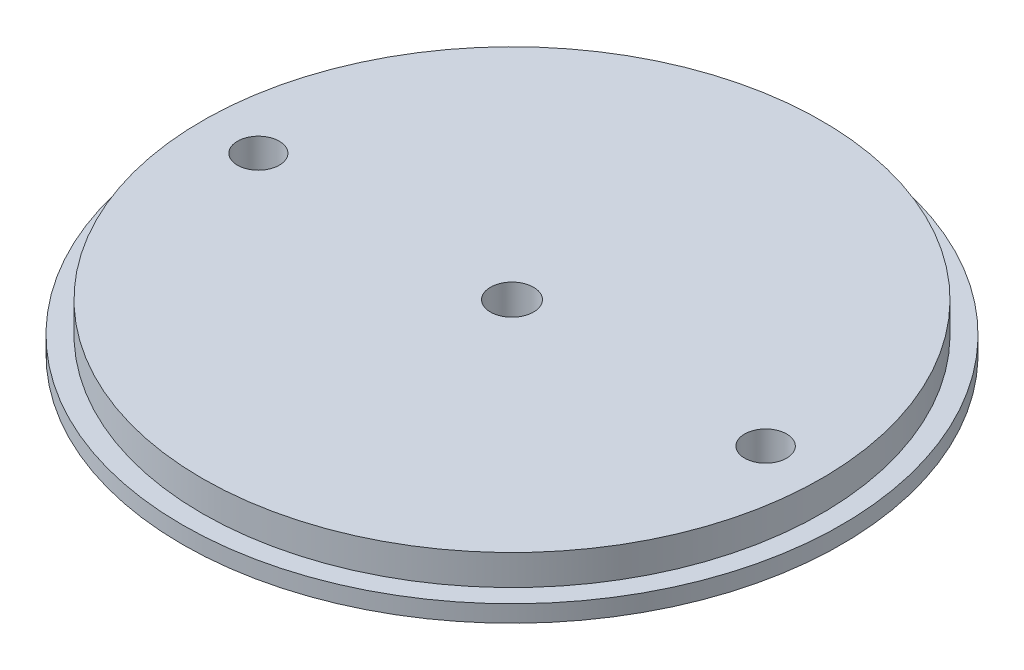
ISO-10303-21;
HEADER;
FILE_DESCRIPTION(('STEP AP214'),'2;1');
FILE_NAME('part.step','',(''),(''),'','','');
FILE_SCHEMA(('AUTOMOTIVE_DESIGN { 1 0 10303 214 1 1 1 1 }'));
ENDSEC;
DATA;
#1=APPLICATION_CONTEXT('core data for automotive mechanical design processes');
#2=APPLICATION_PROTOCOL_DEFINITION('international standard','automotive_design',2000,#1);
#3=PRODUCT_CONTEXT('',#1,'mechanical');
#4=PRODUCT('Part','Part','',(#3));
#5=PRODUCT_RELATED_PRODUCT_CATEGORY('part','',(#4));
#6=PRODUCT_DEFINITION_FORMATION('','',#4);
#7=PRODUCT_DEFINITION_CONTEXT('part definition',#1,'design');
#8=PRODUCT_DEFINITION('design','',#6,#7);
#9=PRODUCT_DEFINITION_SHAPE('','',#8);
#10=(LENGTH_UNIT() NAMED_UNIT(*) SI_UNIT(.MILLI.,.METRE.));
#11=(NAMED_UNIT(*) PLANE_ANGLE_UNIT() SI_UNIT($,.RADIAN.));
#12=(NAMED_UNIT(*) SI_UNIT($,.STERADIAN.) SOLID_ANGLE_UNIT());
#13=UNCERTAINTY_MEASURE_WITH_UNIT(LENGTH_MEASURE(1.E-05),#10,'distance_accuracy_value','');
#14=(GEOMETRIC_REPRESENTATION_CONTEXT(3) GLOBAL_UNCERTAINTY_ASSIGNED_CONTEXT((#13)) GLOBAL_UNIT_ASSIGNED_CONTEXT((#10,
#11,#12)) REPRESENTATION_CONTEXT('',''));
#15=CARTESIAN_POINT('',(0.,0.,0.));
#16=DIRECTION('',(0.,0.,1.));
#17=DIRECTION('',(1.,0.,0.));
#18=AXIS2_PLACEMENT_3D('',#15,#16,#17);
#19=CARTESIAN_POINT('',(0.,2.5908,0.));
#20=DIRECTION('',(0.,-1.,0.));
#21=DIRECTION('',(0.,0.,-1.));
#22=AXIS2_PLACEMENT_3D('',#19,#20,#21);
#23=CYLINDRICAL_SURFACE('',#22,50.4825);
#24=CARTESIAN_POINT('',(0.,2.5908,0.));
#25=DIRECTION('',(0.,1.,0.));
#26=DIRECTION('',(0.,0.,1.));
#27=AXIS2_PLACEMENT_3D('',#24,#25,#26);
#28=CIRCLE('',#27,50.4825);
#29=CARTESIAN_POINT('',(0.,2.5908,50.4825));
#30=VERTEX_POINT('',#29);
#31=EDGE_CURVE('E43',#30,#30,#28,.T.);
#32=ORIENTED_EDGE('',*,*,#31,.F.);
#33=EDGE_LOOP('',(#32));
#34=FACE_BOUND('',#33,.T.);
#35=CARTESIAN_POINT('',(0.,0.,0.));
#36=DIRECTION('',(0.,1.,0.));
#37=DIRECTION('',(0.,0.,1.));
#38=AXIS2_PLACEMENT_3D('',#35,#36,#37);
#39=CIRCLE('',#38,50.4825);
#40=CARTESIAN_POINT('',(0.,0.,50.4825));
#41=VERTEX_POINT('',#40);
#42=EDGE_CURVE('E39',#41,#41,#39,.T.);
#43=ORIENTED_EDGE('',*,*,#42,.T.);
#44=EDGE_LOOP('',(#43));
#45=FACE_BOUND('',#44,.T.);
#46=ADVANCED_FACE('F36',(#34,#45),#23,.T.);
#47=CARTESIAN_POINT('',(0.,2.5908,0.));
#48=DIRECTION('',(0.,1.,0.));
#49=DIRECTION('',(0.,0.,1.));
#50=AXIS2_PLACEMENT_3D('',#47,#48,#49);
#51=PLANE('',#50);
#52=CARTESIAN_POINT('',(0.,2.5908,0.));
#53=DIRECTION('',(0.,1.,0.));
#54=DIRECTION('',(0.,0.,1.));
#55=AXIS2_PLACEMENT_3D('',#52,#53,#54);
#56=CIRCLE('',#55,47.4472);
#57=CARTESIAN_POINT('',(0.,2.5908,47.4472));
#58=VERTEX_POINT('',#57);
#59=EDGE_CURVE('E10',#58,#58,#56,.T.);
#60=ORIENTED_EDGE('',*,*,#59,.F.);
#61=EDGE_LOOP('',(#60));
#62=FACE_BOUND('',#61,.T.);
#63=ORIENTED_EDGE('',*,*,#31,.T.);
#64=EDGE_LOOP('',(#63));
#65=FACE_BOUND('',#64,.T.);
#66=ADVANCED_FACE('F85',(#62,#65),#51,.T.);
#67=CARTESIAN_POINT('',(0.,0.,0.));
#68=DIRECTION('',(0.,1.,0.));
#69=DIRECTION('',(0.,0.,1.));
#70=AXIS2_PLACEMENT_3D('',#67,#68,#69);
#71=PLANE('',#70);
#72=CARTESIAN_POINT('',(-38.852,0.,0.));
#73=DIRECTION('',(0.,-1.,0.));
#74=DIRECTION('',(0.,0.,-1.));
#75=AXIS2_PLACEMENT_3D('',#72,#73,#74);
#76=CIRCLE('',#75,3.2);
#77=CARTESIAN_POINT('',(-38.852,0.,-3.2));
#78=VERTEX_POINT('',#77);
#79=EDGE_CURVE('E65',#78,#78,#76,.T.);
#80=ORIENTED_EDGE('',*,*,#79,.F.);
#81=EDGE_LOOP('',(#80));
#82=FACE_BOUND('',#81,.T.);
#83=CARTESIAN_POINT('',(38.85200002,0.,0.));
#84=DIRECTION('',(0.,-1.,0.));
#85=DIRECTION('',(0.,0.,-1.));
#86=AXIS2_PLACEMENT_3D('',#83,#84,#85);
#87=CIRCLE('',#86,3.22);
#88=CARTESIAN_POINT('',(38.85200002,0.,-3.22));
#89=VERTEX_POINT('',#88);
#90=EDGE_CURVE('E62',#89,#89,#87,.T.);
#91=ORIENTED_EDGE('',*,*,#90,.F.);
#92=EDGE_LOOP('',(#91));
#93=FACE_BOUND('',#92,.T.);
#94=CARTESIAN_POINT('',(0.,0.,0.));
#95=DIRECTION('',(0.,-1.,0.));
#96=DIRECTION('',(0.,0.,-1.));
#97=AXIS2_PLACEMENT_3D('',#94,#95,#96);
#98=CIRCLE('',#97,3.302);
#99=CARTESIAN_POINT('',(0.,0.,-3.302));
#100=VERTEX_POINT('',#99);
#101=EDGE_CURVE('E56',#100,#100,#98,.T.);
#102=ORIENTED_EDGE('',*,*,#101,.F.);
#103=EDGE_LOOP('',(#102));
#104=FACE_BOUND('',#103,.T.);
#105=ORIENTED_EDGE('',*,*,#42,.F.);
#106=EDGE_LOOP('',(#105));
#107=FACE_BOUND('',#106,.T.);
#108=ADVANCED_FACE('F81',(#82,#93,#104,#107),#71,.F.);
#109=CARTESIAN_POINT('',(0.,7.239,0.));
#110=DIRECTION('',(0.,-1.,0.));
#111=DIRECTION('',(0.,0.,-1.));
#112=AXIS2_PLACEMENT_3D('',#109,#110,#111);
#113=CYLINDRICAL_SURFACE('',#112,47.4472);
#114=CARTESIAN_POINT('',(0.,7.239,0.));
#115=DIRECTION('',(0.,1.,0.));
#116=DIRECTION('',(0.,0.,1.));
#117=AXIS2_PLACEMENT_3D('',#114,#115,#116);
#118=CIRCLE('',#117,47.4472);
#119=CARTESIAN_POINT('',(0.,7.239,47.4472));
#120=VERTEX_POINT('',#119);
#121=EDGE_CURVE('E49',#120,#120,#118,.T.);
#122=ORIENTED_EDGE('',*,*,#121,.F.);
#123=EDGE_LOOP('',(#122));
#124=FACE_BOUND('',#123,.T.);
#125=ORIENTED_EDGE('',*,*,#59,.T.);
#126=EDGE_LOOP('',(#125));
#127=FACE_BOUND('',#126,.T.);
#128=ADVANCED_FACE('F84',(#124,#127),#113,.T.);
#129=CARTESIAN_POINT('',(0.,7.239,0.));
#130=DIRECTION('',(0.,1.,0.));
#131=DIRECTION('',(0.,0.,1.));
#132=AXIS2_PLACEMENT_3D('',#129,#130,#131);
#133=PLANE('',#132);
#134=CARTESIAN_POINT('',(-38.852,7.239,0.));
#135=DIRECTION('',(0.,-1.,0.));
#136=DIRECTION('',(0.,0.,-1.));
#137=AXIS2_PLACEMENT_3D('',#134,#135,#136);
#138=CIRCLE('',#137,3.2);
#139=CARTESIAN_POINT('',(-38.852,7.239,-3.2));
#140=VERTEX_POINT('',#139);
#141=EDGE_CURVE('E52',#140,#140,#138,.T.);
#142=ORIENTED_EDGE('',*,*,#141,.T.);
#143=EDGE_LOOP('',(#142));
#144=FACE_BOUND('',#143,.T.);
#145=CARTESIAN_POINT('',(38.85200002,7.239,0.));
#146=DIRECTION('',(0.,-1.,0.));
#147=DIRECTION('',(0.,0.,-1.));
#148=AXIS2_PLACEMENT_3D('',#145,#146,#147);
#149=CIRCLE('',#148,3.22);
#150=CARTESIAN_POINT('',(38.85200002,7.239,-3.22));
#151=VERTEX_POINT('',#150);
#152=EDGE_CURVE('E59',#151,#151,#149,.T.);
#153=ORIENTED_EDGE('',*,*,#152,.T.);
#154=EDGE_LOOP('',(#153));
#155=FACE_BOUND('',#154,.T.);
#156=CARTESIAN_POINT('',(0.,7.239,0.));
#157=DIRECTION('',(0.,-1.,0.));
#158=DIRECTION('',(0.,0.,-1.));
#159=AXIS2_PLACEMENT_3D('',#156,#157,#158);
#160=CIRCLE('',#159,3.302);
#161=CARTESIAN_POINT('',(0.,7.239,-3.302));
#162=VERTEX_POINT('',#161);
#163=EDGE_CURVE('E53',#162,#162,#160,.T.);
#164=ORIENTED_EDGE('',*,*,#163,.T.);
#165=EDGE_LOOP('',(#164));
#166=FACE_BOUND('',#165,.T.);
#167=ORIENTED_EDGE('',*,*,#121,.T.);
#168=EDGE_LOOP('',(#167));
#169=FACE_BOUND('',#168,.T.);
#170=ADVANCED_FACE('F71',(#144,#155,#166,#169),#133,.T.);
#171=CARTESIAN_POINT('',(0.,7.239,0.));
#172=DIRECTION('',(0.,-1.,0.));
#173=DIRECTION('',(0.,0.,-1.));
#174=AXIS2_PLACEMENT_3D('',#171,#172,#173);
#175=CYLINDRICAL_SURFACE('',#174,3.302);
#176=ORIENTED_EDGE('',*,*,#163,.F.);
#177=EDGE_LOOP('',(#176));
#178=FACE_BOUND('',#177,.T.);
#179=ORIENTED_EDGE('',*,*,#101,.T.);
#180=EDGE_LOOP('',(#179));
#181=FACE_BOUND('',#180,.T.);
#182=ADVANCED_FACE('F111',(#178,#181),#175,.F.);
#183=CARTESIAN_POINT('',(38.85200002,7.239,0.));
#184=DIRECTION('',(0.,-1.,0.));
#185=DIRECTION('',(0.,0.,-1.));
#186=AXIS2_PLACEMENT_3D('',#183,#184,#185);
#187=CYLINDRICAL_SURFACE('',#186,3.22);
#188=ORIENTED_EDGE('',*,*,#152,.F.);
#189=EDGE_LOOP('',(#188));
#190=FACE_BOUND('',#189,.T.);
#191=ORIENTED_EDGE('',*,*,#90,.T.);
#192=EDGE_LOOP('',(#191));
#193=FACE_BOUND('',#192,.T.);
#194=ADVANCED_FACE('F77',(#190,#193),#187,.F.);
#195=CARTESIAN_POINT('',(-38.852,7.239,0.));
#196=DIRECTION('',(0.,-1.,0.));
#197=DIRECTION('',(0.,0.,-1.));
#198=AXIS2_PLACEMENT_3D('',#195,#196,#197);
#199=CYLINDRICAL_SURFACE('',#198,3.2);
#200=ORIENTED_EDGE('',*,*,#141,.F.);
#201=EDGE_LOOP('',(#200));
#202=FACE_BOUND('',#201,.T.);
#203=ORIENTED_EDGE('',*,*,#79,.T.);
#204=EDGE_LOOP('',(#203));
#205=FACE_BOUND('',#204,.T.);
#206=ADVANCED_FACE('F74',(#202,#205),#199,.F.);
#207=CLOSED_SHELL('',(#46,#66,#108,#128,#170,#182,#194,#206));
#208=MANIFOLD_SOLID_BREP('B2',#207);
#209=ADVANCED_BREP_SHAPE_REPRESENTATION('',(#18,#208),#14);
#210=SHAPE_DEFINITION_REPRESENTATION(#9,#209);
ENDSEC;
END-ISO-10303-21;
